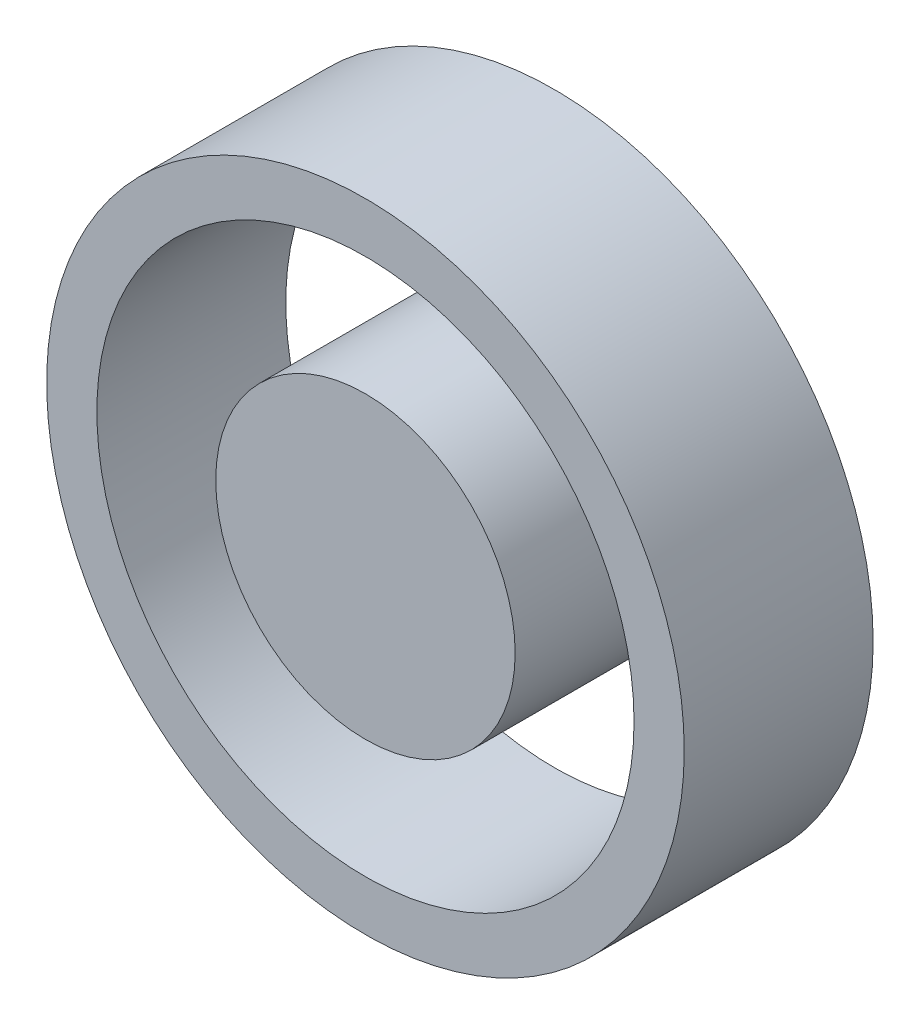
ISO-10303-21;
HEADER;
FILE_DESCRIPTION(('STEP AP214'),'2;1');
FILE_NAME('part.step','',(''),(''),'','','');
FILE_SCHEMA(('AUTOMOTIVE_DESIGN { 1 0 10303 214 1 1 1 1 }'));
ENDSEC;
DATA;
#1=APPLICATION_CONTEXT('core data for automotive mechanical design processes');
#2=APPLICATION_PROTOCOL_DEFINITION('international standard','automotive_design',2000,#1);
#3=PRODUCT_CONTEXT('',#1,'mechanical');
#4=PRODUCT('Part','Part','',(#3));
#5=PRODUCT_RELATED_PRODUCT_CATEGORY('part','',(#4));
#6=PRODUCT_DEFINITION_FORMATION('','',#4);
#7=PRODUCT_DEFINITION_CONTEXT('part definition',#1,'design');
#8=PRODUCT_DEFINITION('design','',#6,#7);
#9=PRODUCT_DEFINITION_SHAPE('','',#8);
#10=(LENGTH_UNIT() NAMED_UNIT(*) SI_UNIT(.MILLI.,.METRE.));
#11=(NAMED_UNIT(*) PLANE_ANGLE_UNIT() SI_UNIT($,.RADIAN.));
#12=(NAMED_UNIT(*) SI_UNIT($,.STERADIAN.) SOLID_ANGLE_UNIT());
#13=UNCERTAINTY_MEASURE_WITH_UNIT(LENGTH_MEASURE(1.E-05),#10,'distance_accuracy_value','');
#14=(GEOMETRIC_REPRESENTATION_CONTEXT(3) GLOBAL_UNCERTAINTY_ASSIGNED_CONTEXT((#13)) GLOBAL_UNIT_ASSIGNED_CONTEXT((#10,
#11,#12)) REPRESENTATION_CONTEXT('',''));
#15=CARTESIAN_POINT('',(0.,0.,0.));
#16=DIRECTION('',(0.,0.,1.));
#17=DIRECTION('',(1.,0.,0.));
#18=AXIS2_PLACEMENT_3D('',#15,#16,#17);
#19=CARTESIAN_POINT('',(0.,0.,50.8));
#20=DIRECTION('',(0.,0.,-1.));
#21=DIRECTION('',(-1.,0.,0.));
#22=AXIS2_PLACEMENT_3D('',#19,#20,#21);
#23=CYLINDRICAL_SURFACE('',#22,40.259);
#24=CARTESIAN_POINT('',(0.,0.,50.8));
#25=DIRECTION('',(0.,0.,1.));
#26=DIRECTION('',(1.,0.,0.));
#27=AXIS2_PLACEMENT_3D('',#24,#25,#26);
#28=CIRCLE('',#27,40.259);
#29=CARTESIAN_POINT('',(40.259,0.,50.8));
#30=VERTEX_POINT('',#29);
#31=EDGE_CURVE('E12',#30,#30,#28,.T.);
#32=ORIENTED_EDGE('',*,*,#31,.F.);
#33=EDGE_LOOP('',(#32));
#34=FACE_BOUND('',#33,.T.);
#35=CARTESIAN_POINT('',(0.,0.,0.));
#36=DIRECTION('',(0.,0.,1.));
#37=DIRECTION('',(1.,0.,0.));
#38=AXIS2_PLACEMENT_3D('',#35,#36,#37);
#39=CIRCLE('',#38,40.259);
#40=CARTESIAN_POINT('',(40.259,0.,0.));
#41=VERTEX_POINT('',#40);
#42=EDGE_CURVE('E50',#41,#41,#39,.T.);
#43=ORIENTED_EDGE('',*,*,#42,.T.);
#44=EDGE_LOOP('',(#43));
#45=FACE_BOUND('',#44,.T.);
#46=ADVANCED_FACE('F47',(#34,#45),#23,.T.);
#47=CARTESIAN_POINT('',(0.,0.,50.8));
#48=DIRECTION('',(0.,0.,1.));
#49=DIRECTION('',(1.,0.,0.));
#50=AXIS2_PLACEMENT_3D('',#47,#48,#49);
#51=PLANE('',#50);
#52=ORIENTED_EDGE('',*,*,#31,.T.);
#53=EDGE_LOOP('',(#52));
#54=FACE_BOUND('',#53,.T.);
#55=ADVANCED_FACE('F62',(#54),#51,.T.);
#56=CARTESIAN_POINT('',(0.,0.,0.));
#57=DIRECTION('',(0.,0.,1.));
#58=DIRECTION('',(1.,0.,0.));
#59=AXIS2_PLACEMENT_3D('',#56,#57,#58);
#60=PLANE('',#59);
#61=ORIENTED_EDGE('',*,*,#42,.F.);
#62=EDGE_LOOP('',(#61));
#63=FACE_BOUND('',#62,.T.);
#64=ADVANCED_FACE('F60',(#63),#60,.F.);
#65=CLOSED_SHELL('',(#46,#55,#64));
#66=MANIFOLD_SOLID_BREP('B2',#65);
#67=CARTESIAN_POINT('',(0.,0.,50.8));
#68=DIRECTION('',(0.,0.,-1.));
#69=DIRECTION('',(-1.,0.,0.));
#70=AXIS2_PLACEMENT_3D('',#67,#68,#69);
#71=CYLINDRICAL_SURFACE('',#70,72.23125);
#72=CARTESIAN_POINT('',(0.,0.,50.8));
#73=DIRECTION('',(0.,0.,1.));
#74=DIRECTION('',(1.,0.,0.));
#75=AXIS2_PLACEMENT_3D('',#72,#73,#74);
#76=CIRCLE('',#75,72.23125);
#77=CARTESIAN_POINT('',(72.23125,0.,50.8));
#78=VERTEX_POINT('',#77);
#79=EDGE_CURVE('E95',#78,#78,#76,.T.);
#80=ORIENTED_EDGE('',*,*,#79,.T.);
#81=EDGE_LOOP('',(#80));
#82=FACE_BOUND('',#81,.T.);
#83=CARTESIAN_POINT('',(0.,0.,0.));
#84=DIRECTION('',(0.,0.,1.));
#85=DIRECTION('',(1.,0.,0.));
#86=AXIS2_PLACEMENT_3D('',#83,#84,#85);
#87=CIRCLE('',#86,72.23125);
#88=CARTESIAN_POINT('',(72.23125,0.,0.));
#89=VERTEX_POINT('',#88);
#90=EDGE_CURVE('E101',#89,#89,#87,.T.);
#91=ORIENTED_EDGE('',*,*,#90,.F.);
#92=EDGE_LOOP('',(#91));
#93=FACE_BOUND('',#92,.T.);
#94=ADVANCED_FACE('F88',(#82,#93),#71,.F.);
#95=CARTESIAN_POINT('',(0.,0.,50.8));
#96=DIRECTION('',(0.,0.,-1.));
#97=DIRECTION('',(-1.,0.,0.));
#98=AXIS2_PLACEMENT_3D('',#95,#96,#97);
#99=CYLINDRICAL_SURFACE('',#98,85.725);
#100=CARTESIAN_POINT('',(0.,0.,50.8));
#101=DIRECTION('',(0.,0.,1.));
#102=DIRECTION('',(1.,0.,0.));
#103=AXIS2_PLACEMENT_3D('',#100,#101,#102);
#104=CIRCLE('',#103,85.725);
#105=CARTESIAN_POINT('',(85.725,0.,50.8));
#106=VERTEX_POINT('',#105);
#107=EDGE_CURVE('E46',#106,#106,#104,.T.);
#108=ORIENTED_EDGE('',*,*,#107,.F.);
#109=EDGE_LOOP('',(#108));
#110=FACE_BOUND('',#109,.T.);
#111=CARTESIAN_POINT('',(0.,0.,0.));
#112=DIRECTION('',(0.,0.,1.));
#113=DIRECTION('',(1.,0.,0.));
#114=AXIS2_PLACEMENT_3D('',#111,#112,#113);
#115=CIRCLE('',#114,85.725);
#116=CARTESIAN_POINT('',(85.725,0.,0.));
#117=VERTEX_POINT('',#116);
#118=EDGE_CURVE('E91',#117,#117,#115,.T.);
#119=ORIENTED_EDGE('',*,*,#118,.T.);
#120=EDGE_LOOP('',(#119));
#121=FACE_BOUND('',#120,.T.);
#122=ADVANCED_FACE('F108',(#110,#121),#99,.T.);
#123=CARTESIAN_POINT('',(0.,0.,50.8));
#124=DIRECTION('',(0.,0.,1.));
#125=DIRECTION('',(1.,0.,0.));
#126=AXIS2_PLACEMENT_3D('',#123,#124,#125);
#127=PLANE('',#126);
#128=ORIENTED_EDGE('',*,*,#79,.F.);
#129=EDGE_LOOP('',(#128));
#130=FACE_BOUND('',#129,.T.);
#131=ORIENTED_EDGE('',*,*,#107,.T.);
#132=EDGE_LOOP('',(#131));
#133=FACE_BOUND('',#132,.T.);
#134=ADVANCED_FACE('F112',(#130,#133),#127,.T.);
#135=CARTESIAN_POINT('',(0.,0.,0.));
#136=DIRECTION('',(0.,0.,1.));
#137=DIRECTION('',(1.,0.,0.));
#138=AXIS2_PLACEMENT_3D('',#135,#136,#137);
#139=PLANE('',#138);
#140=ORIENTED_EDGE('',*,*,#90,.T.);
#141=EDGE_LOOP('',(#140));
#142=FACE_BOUND('',#141,.T.);
#143=ORIENTED_EDGE('',*,*,#118,.F.);
#144=EDGE_LOOP('',(#143));
#145=FACE_BOUND('',#144,.T.);
#146=ADVANCED_FACE('F110',(#142,#145),#139,.F.);
#147=CLOSED_SHELL('',(#94,#122,#134,#146));
#148=MANIFOLD_SOLID_BREP('B7',#147);
#149=ADVANCED_BREP_SHAPE_REPRESENTATION('',(#18,#66,#148),#14);
#150=SHAPE_DEFINITION_REPRESENTATION(#9,#149);
ENDSEC;
END-ISO-10303-21;
